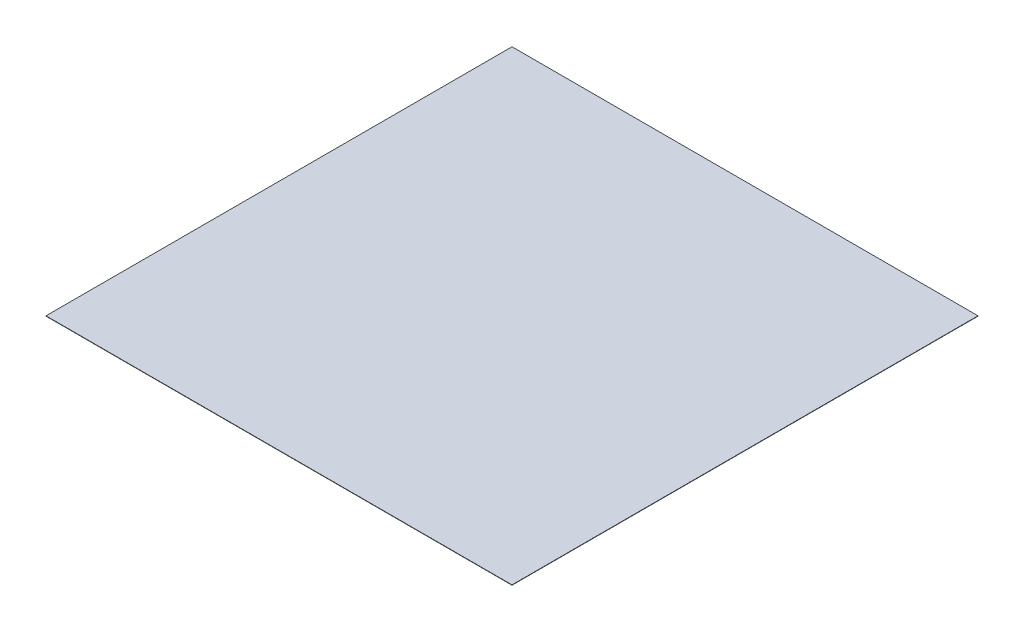
ISO-10303-21;
HEADER;
FILE_DESCRIPTION(('STEP AP214'),'2;1');
FILE_NAME('part.step','',(''),(''),'','','');
FILE_SCHEMA(('AUTOMOTIVE_DESIGN { 1 0 10303 214 1 1 1 1 }'));
ENDSEC;
DATA;
#1=APPLICATION_CONTEXT('core data for automotive mechanical design processes');
#2=APPLICATION_PROTOCOL_DEFINITION('international standard','automotive_design',2000,#1);
#3=PRODUCT_CONTEXT('',#1,'mechanical');
#4=PRODUCT('Part','Part','',(#3));
#5=PRODUCT_RELATED_PRODUCT_CATEGORY('part','',(#4));
#6=PRODUCT_DEFINITION_FORMATION('','',#4);
#7=PRODUCT_DEFINITION_CONTEXT('part definition',#1,'design');
#8=PRODUCT_DEFINITION('design','',#6,#7);
#9=PRODUCT_DEFINITION_SHAPE('','',#8);
#10=(LENGTH_UNIT() NAMED_UNIT(*) SI_UNIT(.MILLI.,.METRE.));
#11=(NAMED_UNIT(*) PLANE_ANGLE_UNIT() SI_UNIT($,.RADIAN.));
#12=(NAMED_UNIT(*) SI_UNIT($,.STERADIAN.) SOLID_ANGLE_UNIT());
#13=UNCERTAINTY_MEASURE_WITH_UNIT(LENGTH_MEASURE(1.E-05),#10,'distance_accuracy_value','');
#14=(GEOMETRIC_REPRESENTATION_CONTEXT(3) GLOBAL_UNCERTAINTY_ASSIGNED_CONTEXT((#13)) GLOBAL_UNIT_ASSIGNED_CONTEXT((#10,
#11,#12)) REPRESENTATION_CONTEXT('',''));
#15=CARTESIAN_POINT('',(0.,0.,0.));
#16=DIRECTION('',(0.,0.,1.));
#17=DIRECTION('',(1.,0.,0.));
#18=AXIS2_PLACEMENT_3D('',#15,#16,#17);
#19=CARTESIAN_POINT('',(47.625,0.065,47.625));
#20=DIRECTION('',(-1.,0.,0.));
#21=DIRECTION('',(0.,0.,1.));
#22=AXIS2_PLACEMENT_3D('',#19,#20,#21);
#23=PLANE('',#22);
#24=DIRECTION('',(0.,0.,-1.));
#25=VECTOR('',#24,1.);
#26=CARTESIAN_POINT('',(47.625,0.,47.625));
#27=LINE('',#26,#25);
#28=CARTESIAN_POINT('',(47.625,0.,47.625));
#29=VERTEX_POINT('',#28);
#30=CARTESIAN_POINT('',(47.625,0.,-47.625));
#31=VERTEX_POINT('',#30);
#32=EDGE_CURVE('E97',#29,#31,#27,.T.);
#33=ORIENTED_EDGE('',*,*,#32,.T.);
#34=DIRECTION('',(0.,-1.,0.));
#35=VECTOR('',#34,1.);
#36=CARTESIAN_POINT('',(47.625,0.065,-47.625));
#37=LINE('',#36,#35);
#38=CARTESIAN_POINT('',(47.625,0.065,-47.625));
#39=VERTEX_POINT('',#38);
#40=EDGE_CURVE('E11',#39,#31,#37,.T.);
#41=ORIENTED_EDGE('',*,*,#40,.F.);
#42=DIRECTION('',(0.,0.,-1.));
#43=VECTOR('',#42,1.);
#44=CARTESIAN_POINT('',(47.625,0.065,47.625));
#45=LINE('',#44,#43);
#46=CARTESIAN_POINT('',(47.625,0.065,47.625));
#47=VERTEX_POINT('',#46);
#48=EDGE_CURVE('E85',#47,#39,#45,.T.);
#49=ORIENTED_EDGE('',*,*,#48,.F.);
#50=DIRECTION('',(0.,-1.,0.));
#51=VECTOR('',#50,1.);
#52=CARTESIAN_POINT('',(47.625,0.065,47.625));
#53=LINE('',#52,#51);
#54=EDGE_CURVE('E93',#47,#29,#53,.T.);
#55=ORIENTED_EDGE('',*,*,#54,.T.);
#56=EDGE_LOOP('',(#33,#41,#49,#55));
#57=FACE_BOUND('',#56,.T.);
#58=ADVANCED_FACE('F34',(#57),#23,.F.);
#59=CARTESIAN_POINT('',(-47.625,0.065,-47.625));
#60=DIRECTION('',(0.,0.,1.));
#61=DIRECTION('',(1.,0.,0.));
#62=AXIS2_PLACEMENT_3D('',#59,#60,#61);
#63=PLANE('',#62);
#64=DIRECTION('',(-1.,0.,0.));
#65=VECTOR('',#64,1.);
#66=CARTESIAN_POINT('',(-47.625,0.,-47.625));
#67=LINE('',#66,#65);
#68=CARTESIAN_POINT('',(-47.625,0.,-47.625));
#69=VERTEX_POINT('',#68);
#70=EDGE_CURVE('E89',#31,#69,#67,.T.);
#71=ORIENTED_EDGE('',*,*,#70,.T.);
#72=DIRECTION('',(0.,-1.,0.));
#73=VECTOR('',#72,1.);
#74=CARTESIAN_POINT('',(-47.625,0.065,-47.625));
#75=LINE('',#74,#73);
#76=CARTESIAN_POINT('',(-47.625,0.065,-47.625));
#77=VERTEX_POINT('',#76);
#78=EDGE_CURVE('E42',#77,#69,#75,.T.);
#79=ORIENTED_EDGE('',*,*,#78,.F.);
#80=DIRECTION('',(-1.,0.,0.));
#81=VECTOR('',#80,1.);
#82=CARTESIAN_POINT('',(-47.625,0.065,-47.625));
#83=LINE('',#82,#81);
#84=EDGE_CURVE('E80',#39,#77,#83,.T.);
#85=ORIENTED_EDGE('',*,*,#84,.F.);
#86=ORIENTED_EDGE('',*,*,#40,.T.);
#87=EDGE_LOOP('',(#71,#79,#85,#86));
#88=FACE_BOUND('',#87,.T.);
#89=ADVANCED_FACE('F88',(#88),#63,.F.);
#90=CARTESIAN_POINT('',(-47.625,0.065,47.625));
#91=DIRECTION('',(1.,0.,0.));
#92=DIRECTION('',(0.,0.,-1.));
#93=AXIS2_PLACEMENT_3D('',#90,#91,#92);
#94=PLANE('',#93);
#95=DIRECTION('',(0.,0.,1.));
#96=VECTOR('',#95,1.);
#97=CARTESIAN_POINT('',(-47.625,0.,47.625));
#98=LINE('',#97,#96);
#99=CARTESIAN_POINT('',(-47.625,0.,47.625));
#100=VERTEX_POINT('',#99);
#101=EDGE_CURVE('E67',#69,#100,#98,.T.);
#102=ORIENTED_EDGE('',*,*,#101,.T.);
#103=DIRECTION('',(0.,-1.,0.));
#104=VECTOR('',#103,1.);
#105=CARTESIAN_POINT('',(-47.625,0.065,47.625));
#106=LINE('',#105,#104);
#107=CARTESIAN_POINT('',(-47.625,0.065,47.625));
#108=VERTEX_POINT('',#107);
#109=EDGE_CURVE('E90',#108,#100,#106,.T.);
#110=ORIENTED_EDGE('',*,*,#109,.F.);
#111=DIRECTION('',(0.,0.,1.));
#112=VECTOR('',#111,1.);
#113=CARTESIAN_POINT('',(-47.625,0.065,47.625));
#114=LINE('',#113,#112);
#115=EDGE_CURVE('E83',#77,#108,#114,.T.);
#116=ORIENTED_EDGE('',*,*,#115,.F.);
#117=ORIENTED_EDGE('',*,*,#78,.T.);
#118=EDGE_LOOP('',(#102,#110,#116,#117));
#119=FACE_BOUND('',#118,.T.);
#120=ADVANCED_FACE('F91',(#119),#94,.F.);
#121=CARTESIAN_POINT('',(-47.625,0.065,47.625));
#122=DIRECTION('',(0.,0.,-1.));
#123=DIRECTION('',(-1.,0.,0.));
#124=AXIS2_PLACEMENT_3D('',#121,#122,#123);
#125=PLANE('',#124);
#126=DIRECTION('',(1.,0.,0.));
#127=VECTOR('',#126,1.);
#128=CARTESIAN_POINT('',(-47.625,0.,47.625));
#129=LINE('',#128,#127);
#130=EDGE_CURVE('E73',#100,#29,#129,.T.);
#131=ORIENTED_EDGE('',*,*,#130,.T.);
#132=ORIENTED_EDGE('',*,*,#54,.F.);
#133=DIRECTION('',(1.,0.,0.));
#134=VECTOR('',#133,1.);
#135=CARTESIAN_POINT('',(-47.625,0.065,47.625));
#136=LINE('',#135,#134);
#137=EDGE_CURVE('E50',#108,#47,#136,.T.);
#138=ORIENTED_EDGE('',*,*,#137,.F.);
#139=ORIENTED_EDGE('',*,*,#109,.T.);
#140=EDGE_LOOP('',(#131,#132,#138,#139));
#141=FACE_BOUND('',#140,.T.);
#142=ADVANCED_FACE('F104',(#141),#125,.F.);
#143=CARTESIAN_POINT('',(0.,0.065,0.));
#144=DIRECTION('',(0.,-1.,0.));
#145=DIRECTION('',(0.,0.,-1.));
#146=AXIS2_PLACEMENT_3D('',#143,#144,#145);
#147=PLANE('',#146);
#148=ORIENTED_EDGE('',*,*,#48,.T.);
#149=ORIENTED_EDGE('',*,*,#84,.T.);
#150=ORIENTED_EDGE('',*,*,#115,.T.);
#151=ORIENTED_EDGE('',*,*,#137,.T.);
#152=EDGE_LOOP('',(#148,#149,#150,#151));
#153=FACE_BOUND('',#152,.T.);
#154=ADVANCED_FACE('F81',(#153),#147,.F.);
#155=CARTESIAN_POINT('',(0.,0.,0.));
#156=DIRECTION('',(0.,-1.,0.));
#157=DIRECTION('',(0.,0.,-1.));
#158=AXIS2_PLACEMENT_3D('',#155,#156,#157);
#159=PLANE('',#158);
#160=ORIENTED_EDGE('',*,*,#32,.F.);
#161=ORIENTED_EDGE('',*,*,#130,.F.);
#162=ORIENTED_EDGE('',*,*,#101,.F.);
#163=ORIENTED_EDGE('',*,*,#70,.F.);
#164=EDGE_LOOP('',(#160,#161,#162,#163));
#165=FACE_BOUND('',#164,.T.);
#166=ADVANCED_FACE('F107',(#165),#159,.T.);
#167=CLOSED_SHELL('',(#58,#89,#120,#142,#154,#166));
#168=MANIFOLD_SOLID_BREP('B2',#167);
#169=ADVANCED_BREP_SHAPE_REPRESENTATION('',(#18,#168),#14);
#170=SHAPE_DEFINITION_REPRESENTATION(#9,#169);
ENDSEC;
END-ISO-10303-21;
